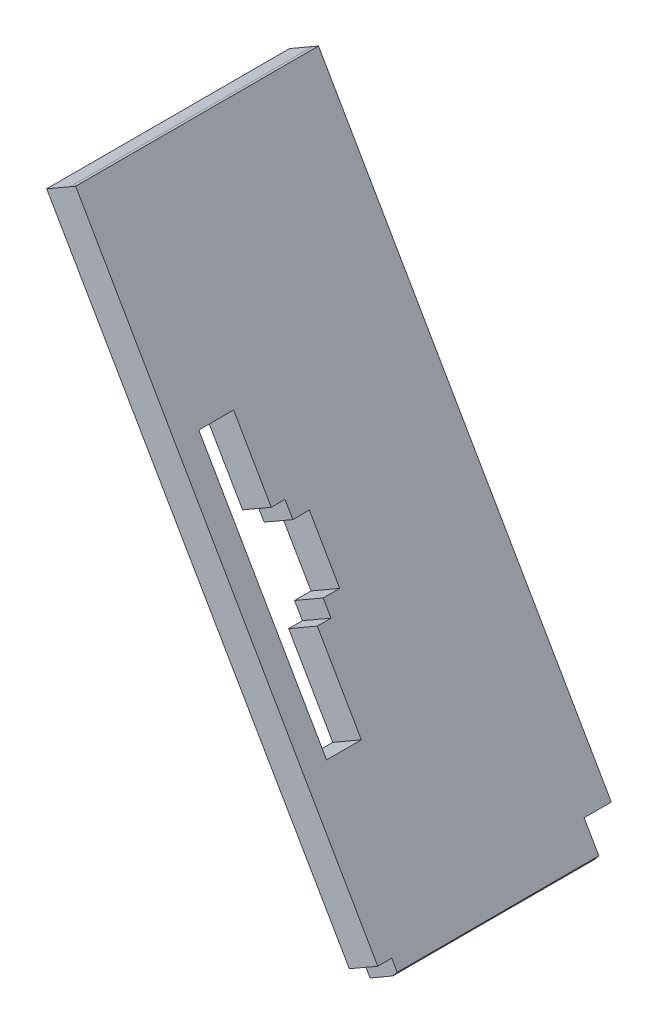
ISO-10303-21;
HEADER;
FILE_DESCRIPTION(('STEP AP214'),'2;1');
FILE_NAME('part.step','',(''),(''),'','','');
FILE_SCHEMA(('AUTOMOTIVE_DESIGN { 1 0 10303 214 1 1 1 1 }'));
ENDSEC;
DATA;
#1=APPLICATION_CONTEXT('core data for automotive mechanical design processes');
#2=APPLICATION_PROTOCOL_DEFINITION('international standard','automotive_design',2000,#1);
#3=PRODUCT_CONTEXT('',#1,'mechanical');
#4=PRODUCT('Part','Part','',(#3));
#5=PRODUCT_RELATED_PRODUCT_CATEGORY('part','',(#4));
#6=PRODUCT_DEFINITION_FORMATION('','',#4);
#7=PRODUCT_DEFINITION_CONTEXT('part definition',#1,'design');
#8=PRODUCT_DEFINITION('design','',#6,#7);
#9=PRODUCT_DEFINITION_SHAPE('','',#8);
#10=(LENGTH_UNIT() NAMED_UNIT(*) SI_UNIT(.MILLI.,.METRE.));
#11=(NAMED_UNIT(*) PLANE_ANGLE_UNIT() SI_UNIT($,.RADIAN.));
#12=(NAMED_UNIT(*) SI_UNIT($,.STERADIAN.) SOLID_ANGLE_UNIT());
#13=UNCERTAINTY_MEASURE_WITH_UNIT(LENGTH_MEASURE(1.E-05),#10,'distance_accuracy_value','');
#14=(GEOMETRIC_REPRESENTATION_CONTEXT(3) GLOBAL_UNCERTAINTY_ASSIGNED_CONTEXT((#13)) GLOBAL_UNIT_ASSIGNED_CONTEXT((#10,
#11,#12)) REPRESENTATION_CONTEXT('',''));
#15=CARTESIAN_POINT('',(0.,0.,0.));
#16=DIRECTION('',(0.,0.,1.));
#17=DIRECTION('',(1.,0.,0.));
#18=AXIS2_PLACEMENT_3D('',#15,#16,#17);
#19=CARTESIAN_POINT('',(-99.0231663196194,0.488544370295804,135.578542747507));
#20=DIRECTION('',(-0.866503571633321,-0.499170872894943,0.));
#21=DIRECTION('',(0.499170872894943,-0.866503571633321,0.));
#22=AXIS2_PLACEMENT_3D('',#19,#20,#21);
#23=PLANE('',#22);
#24=DIRECTION('',(-0.499170872894943,0.866503571633321,0.));
#25=VECTOR('',#24,1.);
#26=CARTESIAN_POINT('',(-99.0231663196194,0.488544370295804,4.14252736415929));
#27=LINE('',#26,#25);
#28=CARTESIAN_POINT('',(-52.1531074228579,-80.8725198303702,4.14252736415929));
#29=VERTEX_POINT('',#28);
#30=CARTESIAN_POINT('',(-54.4002134893503,-76.971800581344,4.14252736415929));
#31=VERTEX_POINT('',#30);
#32=EDGE_CURVE('E279',#29,#31,#27,.T.);
#33=ORIENTED_EDGE('',*,*,#32,.T.);
#34=DIRECTION('',(0.,0.,-1.));
#35=VECTOR('',#34,1.);
#36=CARTESIAN_POINT('',(-54.4002134893503,-76.971800581344,135.578542747507));
#37=LINE('',#36,#35);
#38=CARTESIAN_POINT('',(-54.4002134893503,-76.971800581344,0.));
#39=VERTEX_POINT('',#38);
#40=EDGE_CURVE('E282',#31,#39,#37,.T.);
#41=ORIENTED_EDGE('',*,*,#40,.T.);
#42=DIRECTION('',(-0.499170872894943,0.866503571633321,0.));
#43=VECTOR('',#42,1.);
#44=CARTESIAN_POINT('',(-99.0231663196194,0.488544370295804,0.));
#45=LINE('',#44,#43);
#46=CARTESIAN_POINT('',(-99.0231663196194,0.488544370295804,0.));
#47=VERTEX_POINT('',#46);
#48=EDGE_CURVE('E306',#39,#47,#45,.T.);
#49=ORIENTED_EDGE('',*,*,#48,.T.);
#50=DIRECTION('',(0.,0.,-1.));
#51=VECTOR('',#50,1.);
#52=CARTESIAN_POINT('',(-99.0231663196194,0.488544370295804,135.578542747507));
#53=LINE('',#52,#51);
#54=CARTESIAN_POINT('',(-99.0231663196194,0.488544370295804,37.));
#55=VERTEX_POINT('',#54);
#56=EDGE_CURVE('E308',#55,#47,#53,.T.);
#57=ORIENTED_EDGE('',*,*,#56,.F.);
#58=DIRECTION('',(0.499170872894943,-0.866503571633321,0.));
#59=VECTOR('',#58,1.);
#60=CARTESIAN_POINT('',(-99.0231663196194,0.488544370295804,37.));
#61=LINE('',#60,#59);
#62=CARTESIAN_POINT('',(-52.9859566816006,-79.4267887260144,37.));
#63=VERTEX_POINT('',#62);
#64=EDGE_CURVE('E291',#55,#63,#61,.T.);
#65=ORIENTED_EDGE('',*,*,#64,.T.);
#66=DIRECTION('',(0.,0.,-1.));
#67=VECTOR('',#66,1.);
#68=CARTESIAN_POINT('',(-52.9859566816006,-79.4267887260144,135.578542747507));
#69=LINE('',#68,#67);
#70=CARTESIAN_POINT('',(-52.9859566816006,-79.4267887260144,34.8637221211661));
#71=VERTEX_POINT('',#70);
#72=EDGE_CURVE('E256',#63,#71,#69,.T.);
#73=ORIENTED_EDGE('',*,*,#72,.T.);
#74=DIRECTION('',(0.499170872894943,-0.866503571633321,0.));
#75=VECTOR('',#74,1.);
#76=CARTESIAN_POINT('',(-99.0231663196194,0.488544370295804,34.8637221211661));
#77=LINE('',#76,#75);
#78=CARTESIAN_POINT('',(-52.1531074228579,-80.8725198303702,34.8637221211661));
#79=VERTEX_POINT('',#78);
#80=EDGE_CURVE('E270',#71,#79,#77,.T.);
#81=ORIENTED_EDGE('',*,*,#80,.T.);
#82=DIRECTION('',(0.,0.,-1.));
#83=VECTOR('',#82,1.);
#84=CARTESIAN_POINT('',(-52.1531074228579,-80.8725198303702,135.578542747507));
#85=LINE('',#84,#83);
#86=EDGE_CURVE('E311',#79,#29,#85,.T.);
#87=ORIENTED_EDGE('',*,*,#86,.T.);
#88=EDGE_LOOP('',(#33,#41,#49,#57,#65,#73,#81,#87));
#89=FACE_BOUND('',#88,.T.);
#90=DIRECTION('',(0.,0.,-1.));
#91=VECTOR('',#90,1.);
#92=CARTESIAN_POINT('',(-78.0849272768483,-35.8578450114659,28.2244095305818));
#93=LINE('',#92,#91);
#94=CARTESIAN_POINT('',(-78.0849272768483,-35.8578450114659,28.1244095305818));
#95=VERTEX_POINT('',#94);
#96=CARTESIAN_POINT('',(-78.0849272768483,-35.8578450114659,26.0345876074907));
#97=VERTEX_POINT('',#96);
#98=EDGE_CURVE('E186',#95,#97,#93,.T.);
#99=ORIENTED_EDGE('',*,*,#98,.T.);
#100=DIRECTION('',(0.499170872894944,-0.86650357163332,0.));
#101=VECTOR('',#100,1.);
#102=CARTESIAN_POINT('',(-78.0849272768483,-35.8578450114659,26.0345876074907));
#103=LINE('',#102,#101);
#104=CARTESIAN_POINT('',(-76.8922490162016,-37.9281981285582,26.0345876074907));
#105=VERTEX_POINT('',#104);
#106=EDGE_CURVE('E195',#97,#105,#103,.T.);
#107=ORIENTED_EDGE('',*,*,#106,.T.);
#108=DIRECTION('',(0.,0.,-1.));
#109=VECTOR('',#108,1.);
#110=CARTESIAN_POINT('',(-76.8922490162016,-37.9281981285582,26.0345876074907));
#111=LINE('',#110,#109);
#112=CARTESIAN_POINT('',(-76.8922490162016,-37.9281981285582,23.5161166286644));
#113=VERTEX_POINT('',#112);
#114=EDGE_CURVE('E201',#105,#113,#111,.T.);
#115=ORIENTED_EDGE('',*,*,#114,.T.);
#116=DIRECTION('',(0.499170872894942,-0.866503571633321,0.));
#117=VECTOR('',#116,1.);
#118=CARTESIAN_POINT('',(-76.8922490162016,-37.9281981285582,23.5161166286644));
#119=LINE('',#118,#117);
#120=CARTESIAN_POINT('',(-72.2693642825685,-45.9529975518718,23.5161166286644));
#121=VERTEX_POINT('',#120);
#122=EDGE_CURVE('E209',#113,#121,#119,.T.);
#123=ORIENTED_EDGE('',*,*,#122,.T.);
#124=DIRECTION('',(0.,0.,1.));
#125=VECTOR('',#124,1.);
#126=CARTESIAN_POINT('',(-72.2693642825685,-45.9529975518718,26.0345876074907));
#127=LINE('',#126,#125);
#128=CARTESIAN_POINT('',(-72.2693642825685,-45.9529975518718,26.0345876074907));
#129=VERTEX_POINT('',#128);
#130=EDGE_CURVE('E212',#121,#129,#127,.T.);
#131=ORIENTED_EDGE('',*,*,#130,.T.);
#132=DIRECTION('',(0.499170872894943,-0.86650357163332,0.));
#133=VECTOR('',#132,1.);
#134=CARTESIAN_POINT('',(-71.0766860219218,-48.0233506689642,26.0345876074907));
#135=LINE('',#134,#133);
#136=CARTESIAN_POINT('',(-71.0766860219218,-48.0233506689642,26.0345876074907));
#137=VERTEX_POINT('',#136);
#138=EDGE_CURVE('E215',#129,#137,#135,.T.);
#139=ORIENTED_EDGE('',*,*,#138,.T.);
#140=DIRECTION('',(0.,0.,1.));
#141=VECTOR('',#140,1.);
#142=CARTESIAN_POINT('',(-71.0766860219218,-48.0233506689642,28.7263611934285));
#143=LINE('',#142,#141);
#144=CARTESIAN_POINT('',(-71.0766860219218,-48.0233506689642,28.1244095305818));
#145=VERTEX_POINT('',#144);
#146=EDGE_CURVE('E218',#137,#145,#143,.T.);
#147=ORIENTED_EDGE('',*,*,#146,.T.);
#148=DIRECTION('',(0.499170872894943,-0.86650357163332,0.));
#149=VECTOR('',#148,1.);
#150=CARTESIAN_POINT('',(-74.1380977270059,-42.7090899203133,28.1244095305818));
#151=LINE('',#150,#149);
#152=CARTESIAN_POINT('',(-64.3623781344977,-59.6786216020566,28.1244095305818));
#153=VERTEX_POINT('',#152);
#154=EDGE_CURVE('E239',#145,#153,#151,.T.);
#155=ORIENTED_EDGE('',*,*,#154,.T.);
#156=DIRECTION('',(0.,0.,-1.));
#157=VECTOR('',#156,1.);
#158=CARTESIAN_POINT('',(-64.3623781344977,-59.6786216020566,0.));
#159=LINE('',#158,#157);
#160=CARTESIAN_POINT('',(-64.3623781344977,-59.6786216020566,33.4244095305818));
#161=VERTEX_POINT('',#160);
#162=EDGE_CURVE('E236',#161,#153,#159,.T.);
#163=ORIENTED_EDGE('',*,*,#162,.F.);
#164=DIRECTION('',(-0.499170872894943,0.86650357163332,0.));
#165=VECTOR('',#164,1.);
#166=CARTESIAN_POINT('',(-74.1380977270059,-42.7090899203133,33.4244095305818));
#167=LINE('',#166,#165);
#168=CARTESIAN_POINT('',(-83.8300421774005,-25.8849823083569,33.4244095305818));
#169=VERTEX_POINT('',#168);
#170=EDGE_CURVE('E233',#161,#169,#167,.T.);
#171=ORIENTED_EDGE('',*,*,#170,.T.);
#172=DIRECTION('',(0.,0.,-1.));
#173=VECTOR('',#172,1.);
#174=CARTESIAN_POINT('',(-83.8300421774006,-25.8849823083569,0.));
#175=LINE('',#174,#173);
#176=CARTESIAN_POINT('',(-83.8300421774006,-25.8849823083569,28.1244095305818));
#177=VERTEX_POINT('',#176);
#178=EDGE_CURVE('E56',#169,#177,#175,.T.);
#179=ORIENTED_EDGE('',*,*,#178,.T.);
#180=EDGE_CURVE('E205',#177,#95,#151,.T.);
#181=ORIENTED_EDGE('',*,*,#180,.T.);
#182=EDGE_LOOP('',(#99,#107,#115,#123,#131,#139,#147,#155,#163,#171,#179,#181));
#183=FACE_BOUND('',#182,.T.);
#184=ADVANCED_FACE('F33',(#89,#183),#23,.F.);
#185=CARTESIAN_POINT('',(-103.432664129137,-2.05617517957898,135.578542747507));
#186=DIRECTION('',(0.866025403784438,0.5,0.));
#187=DIRECTION('',(-0.5,0.866025403784438,0.));
#188=AXIS2_PLACEMENT_3D('',#185,#186,#187);
#189=PLANE('',#188);
#190=DIRECTION('',(0.5,-0.866025403784438,0.));
#191=VECTOR('',#190,1.);
#192=CARTESIAN_POINT('',(-103.432664129137,-2.05617517957898,0.));
#193=LINE('',#192,#191);
#194=CARTESIAN_POINT('',(-103.432664129137,-2.05617517957898,0.));
#195=VERTEX_POINT('',#194);
#196=CARTESIAN_POINT('',(-58.7351341000267,-79.4745681628336,0.));
#197=VERTEX_POINT('',#196);
#198=EDGE_CURVE('E303',#195,#197,#193,.T.);
#199=ORIENTED_EDGE('',*,*,#198,.T.);
#200=DIRECTION('',(0.,0.,-1.));
#201=VECTOR('',#200,1.);
#202=CARTESIAN_POINT('',(-58.7351341000267,-79.4745681628336,-0.114610865347801));
#203=LINE('',#202,#201);
#204=CARTESIAN_POINT('',(-58.7351341000267,-79.4745681628336,4.14252736415928));
#205=VERTEX_POINT('',#204);
#206=EDGE_CURVE('E251',#205,#197,#203,.T.);
#207=ORIENTED_EDGE('',*,*,#206,.F.);
#208=DIRECTION('',(0.5,-0.866025403784438,0.));
#209=VECTOR('',#208,1.);
#210=CARTESIAN_POINT('',(-103.432664129137,-2.05617517957898,4.14252736415929));
#211=LINE('',#210,#209);
#212=CARTESIAN_POINT('',(-56.2941221076292,-83.702524955551,4.14252736415929));
#213=VERTEX_POINT('',#212);
#214=EDGE_CURVE('E328',#205,#213,#211,.T.);
#215=ORIENTED_EDGE('',*,*,#214,.T.);
#216=DIRECTION('',(0.,0.,-1.));
#217=VECTOR('',#216,1.);
#218=CARTESIAN_POINT('',(-56.2941221076292,-83.702524955551,135.578542747507));
#219=LINE('',#218,#217);
#220=CARTESIAN_POINT('',(-56.2941221076292,-83.702524955551,34.8637221211661));
#221=VERTEX_POINT('',#220);
#222=EDGE_CURVE('E317',#221,#213,#219,.T.);
#223=ORIENTED_EDGE('',*,*,#222,.F.);
#224=DIRECTION('',(0.500000000000001,-0.866025403784438,0.));
#225=VECTOR('',#224,1.);
#226=CARTESIAN_POINT('',(-56.2941221076293,-83.702524955551,34.8637221211661));
#227=LINE('',#226,#225);
#228=CARTESIAN_POINT('',(-57.3185288484522,-81.9282004328296,34.8637221211661));
#229=VERTEX_POINT('',#228);
#230=EDGE_CURVE('E259',#229,#221,#227,.T.);
#231=ORIENTED_EDGE('',*,*,#230,.F.);
#232=DIRECTION('',(0.,0.,-1.));
#233=VECTOR('',#232,1.);
#234=CARTESIAN_POINT('',(-57.3185288484522,-81.9282004328296,34.8637221211661));
#235=LINE('',#234,#233);
#236=CARTESIAN_POINT('',(-57.3185288484522,-81.9282004328296,37.));
#237=VERTEX_POINT('',#236);
#238=EDGE_CURVE('E244',#237,#229,#235,.T.);
#239=ORIENTED_EDGE('',*,*,#238,.F.);
#240=DIRECTION('',(-0.5,0.866025403784438,0.));
#241=VECTOR('',#240,1.);
#242=CARTESIAN_POINT('',(-103.432664129137,-2.05617517957898,37.));
#243=LINE('',#242,#241);
#244=CARTESIAN_POINT('',(-103.432664129137,-2.05617517957898,37.));
#245=VERTEX_POINT('',#244);
#246=EDGE_CURVE('E288',#237,#245,#243,.T.);
#247=ORIENTED_EDGE('',*,*,#246,.T.);
#248=DIRECTION('',(0.,0.,-1.));
#249=VECTOR('',#248,1.);
#250=CARTESIAN_POINT('',(-103.432664129137,-2.05617517957898,135.578542747507));
#251=LINE('',#250,#249);
#252=EDGE_CURVE('E320',#245,#195,#251,.T.);
#253=ORIENTED_EDGE('',*,*,#252,.T.);
#254=EDGE_LOOP('',(#199,#207,#215,#223,#231,#239,#247,#253));
#255=FACE_BOUND('',#254,.T.);
#256=DIRECTION('',(0.,0.,-1.));
#257=VECTOR('',#256,1.);
#258=CARTESIAN_POINT('',(-82.4615947398938,-38.3791328508007,135.578542747507));
#259=LINE('',#258,#257);
#260=CARTESIAN_POINT('',(-82.4615947398938,-38.3791328508007,28.1244095305818));
#261=VERTEX_POINT('',#260);
#262=CARTESIAN_POINT('',(-82.4615947398938,-38.3791328508007,26.0345876074907));
#263=VERTEX_POINT('',#262);
#264=EDGE_CURVE('E189',#261,#263,#259,.T.);
#265=ORIENTED_EDGE('',*,*,#264,.F.);
#266=DIRECTION('',(0.5,-0.866025403784438,0.));
#267=VECTOR('',#266,1.);
#268=CARTESIAN_POINT('',(-103.432664129137,-2.05617517957898,28.1244095305818));
#269=LINE('',#268,#267);
#270=CARTESIAN_POINT('',(-88.2162549615267,-28.411768966637,28.1244095305818));
#271=VERTEX_POINT('',#270);
#272=EDGE_CURVE('E337',#271,#261,#269,.T.);
#273=ORIENTED_EDGE('',*,*,#272,.F.);
#274=DIRECTION('',(0.,0.,-1.));
#275=VECTOR('',#274,1.);
#276=CARTESIAN_POINT('',(-88.2162549615267,-28.411768966637,135.578542747507));
#277=LINE('',#276,#275);
#278=CARTESIAN_POINT('',(-88.2162549615267,-28.411768966637,33.4244095305818));
#279=VERTEX_POINT('',#278);
#280=EDGE_CURVE('E340',#279,#271,#277,.T.);
#281=ORIENTED_EDGE('',*,*,#280,.F.);
#282=DIRECTION('',(-0.5,0.866025403784438,0.));
#283=VECTOR('',#282,1.);
#284=CARTESIAN_POINT('',(-103.432664129137,-2.05617517957898,33.4244095305818));
#285=LINE('',#284,#283);
#286=CARTESIAN_POINT('',(-68.716246029584,-62.1867751848086,33.4244095305818));
#287=VERTEX_POINT('',#286);
#288=EDGE_CURVE('E331',#287,#279,#285,.T.);
#289=ORIENTED_EDGE('',*,*,#288,.F.);
#290=DIRECTION('',(0.,0.,-1.));
#291=VECTOR('',#290,1.);
#292=CARTESIAN_POINT('',(-68.716246029584,-62.1867751848086,135.578542747507));
#293=LINE('',#292,#291);
#294=CARTESIAN_POINT('',(-68.716246029584,-62.1867751848086,28.1244095305818));
#295=VERTEX_POINT('',#294);
#296=EDGE_CURVE('E333',#287,#295,#293,.T.);
#297=ORIENTED_EDGE('',*,*,#296,.T.);
#298=CARTESIAN_POINT('',(-75.4417095206347,-50.5379307138593,28.1244095305818));
#299=VERTEX_POINT('',#298);
#300=EDGE_CURVE('E336',#299,#295,#269,.T.);
#301=ORIENTED_EDGE('',*,*,#300,.F.);
#302=DIRECTION('',(0.,0.,1.));
#303=VECTOR('',#302,1.);
#304=CARTESIAN_POINT('',(-75.4417095206347,-50.5379307138593,135.578542747507));
#305=LINE('',#304,#303);
#306=CARTESIAN_POINT('',(-75.4417095206347,-50.5379307138593,26.0345876074907));
#307=VERTEX_POINT('',#306);
#308=EDGE_CURVE('E48',#307,#299,#305,.T.);
#309=ORIENTED_EDGE('',*,*,#308,.F.);
#310=DIRECTION('',(0.5,-0.866025403784438,0.));
#311=VECTOR('',#310,1.);
#312=CARTESIAN_POINT('',(-103.432664129137,-2.05617517957898,26.0345876074907));
#313=LINE('',#312,#311);
#314=CARTESIAN_POINT('',(-76.6363693773227,-48.4687191443128,26.0345876074907));
#315=VERTEX_POINT('',#314);
#316=EDGE_CURVE('E346',#315,#307,#313,.T.);
#317=ORIENTED_EDGE('',*,*,#316,.F.);
#318=DIRECTION('',(0.,0.,1.));
#319=VECTOR('',#318,1.);
#320=CARTESIAN_POINT('',(-76.6363693773227,-48.4687191443128,135.578542747507));
#321=LINE('',#320,#319);
#322=CARTESIAN_POINT('',(-76.6363693773227,-48.4687191443128,23.5161166286644));
#323=VERTEX_POINT('',#322);
#324=EDGE_CURVE('E348',#323,#315,#321,.T.);
#325=ORIENTED_EDGE('',*,*,#324,.F.);
#326=DIRECTION('',(0.5,-0.866025403784438,0.));
#327=VECTOR('',#326,1.);
#328=CARTESIAN_POINT('',(-103.432664129137,-2.05617517957898,23.5161166286644));
#329=LINE('',#328,#327);
#330=CARTESIAN_POINT('',(-81.2669348832058,-40.4483444203473,23.5161166286644));
#331=VERTEX_POINT('',#330);
#332=EDGE_CURVE('E350',#331,#323,#329,.T.);
#333=ORIENTED_EDGE('',*,*,#332,.F.);
#334=DIRECTION('',(0.,0.,-1.));
#335=VECTOR('',#334,1.);
#336=CARTESIAN_POINT('',(-81.2669348832058,-40.4483444203473,135.578542747507));
#337=LINE('',#336,#335);
#338=CARTESIAN_POINT('',(-81.2669348832058,-40.4483444203473,26.0345876074907));
#339=VERTEX_POINT('',#338);
#340=EDGE_CURVE('E41',#339,#331,#337,.T.);
#341=ORIENTED_EDGE('',*,*,#340,.F.);
#342=DIRECTION('',(0.5,-0.866025403784439,0.));
#343=VECTOR('',#342,1.);
#344=CARTESIAN_POINT('',(-103.432664129137,-2.05617517957898,26.0345876074907));
#345=LINE('',#344,#343);
#346=EDGE_CURVE('E11',#263,#339,#345,.T.);
#347=ORIENTED_EDGE('',*,*,#346,.F.);
#348=EDGE_LOOP('',(#265,#273,#281,#289,#297,#301,#309,#317,#325,#333,#341,#347));
#349=FACE_BOUND('',#348,.T.);
#350=ADVANCED_FACE('F362',(#255,#349),#189,.F.);
#351=CARTESIAN_POINT('',(-82.8031334433391,-47.7007986492627,28.1244095305818));
#352=DIRECTION('',(0.,0.,1.));
#353=DIRECTION('',(1.,0.,0.));
#354=AXIS2_PLACEMENT_3D('',#351,#352,#353);
#355=PLANE('',#354);
#356=ORIENTED_EDGE('',*,*,#272,.T.);
#357=DIRECTION('',(0.866503571633321,0.499170872894943,0.));
#358=VECTOR('',#357,1.);
#359=CARTESIAN_POINT('',(-86.7499629931815,-40.8495537404153,28.1244095305818));
#360=LINE('',#359,#358);
#361=EDGE_CURVE('E344',#261,#95,#360,.T.);
#362=ORIENTED_EDGE('',*,*,#361,.T.);
#363=ORIENTED_EDGE('',*,*,#180,.F.);
#364=DIRECTION('',(0.866503571633321,0.499170872894943,0.));
#365=VECTOR('',#364,1.);
#366=CARTESIAN_POINT('',(-92.4950778937338,-30.8766910373063,28.1244095305818));
#367=LINE('',#366,#365);
#368=EDGE_CURVE('E242',#271,#177,#367,.T.);
#369=ORIENTED_EDGE('',*,*,#368,.F.);
#370=EDGE_LOOP('',(#356,#362,#363,#369));
#371=FACE_BOUND('',#370,.T.);
#372=ADVANCED_FACE('F390',(#371),#355,.T.);
#373=ORIENTED_EDGE('',*,*,#154,.F.);
#374=DIRECTION('',(-0.866503571633321,-0.499170872894943,0.));
#375=VECTOR('',#374,1.);
#376=CARTESIAN_POINT('',(-79.741721738255,-53.0150593979136,28.1244095305818));
#377=LINE('',#376,#375);
#378=EDGE_CURVE('E342',#145,#299,#377,.T.);
#379=ORIENTED_EDGE('',*,*,#378,.T.);
#380=ORIENTED_EDGE('',*,*,#300,.T.);
#381=DIRECTION('',(0.866503571633321,0.499170872894943,0.));
#382=VECTOR('',#381,1.);
#383=CARTESIAN_POINT('',(-73.0274138508309,-64.670330331006,28.1244095305818));
#384=LINE('',#383,#382);
#385=EDGE_CURVE('E245',#295,#153,#384,.T.);
#386=ORIENTED_EDGE('',*,*,#385,.T.);
#387=EDGE_LOOP('',(#373,#379,#380,#386));
#388=FACE_BOUND('',#387,.T.);
#389=ADVANCED_FACE('F375',(#388),#355,.T.);
#390=CARTESIAN_POINT('',(0.,0.,0.));
#391=DIRECTION('',(0.,0.,-1.));
#392=DIRECTION('',(-1.,0.,0.));
#393=AXIS2_PLACEMENT_3D('',#390,#391,#392);
#394=PLANE('',#393);
#395=DIRECTION('',(0.866025403784438,0.500000000000001,0.));
#396=VECTOR('',#395,1.);
#397=CARTESIAN_POINT('',(19.7297139668993,-34.1728670094708,0.));
#398=LINE('',#397,#396);
#399=EDGE_CURVE('E285',#197,#39,#398,.T.);
#400=ORIENTED_EDGE('',*,*,#399,.F.);
#401=ORIENTED_EDGE('',*,*,#198,.F.);
#402=DIRECTION('',(-0.866025403784436,-0.500000000000005,0.));
#403=VECTOR('',#402,1.);
#404=CARTESIAN_POINT('',(-102.367816062211,-1.44138486149341,0.));
#405=LINE('',#404,#403);
#406=CARTESIAN_POINT('',(-99.8896698912527,-0.0106265025991386,0.));
#407=VERTEX_POINT('',#406);
#408=EDGE_CURVE('E300',#407,#195,#405,.T.);
#409=ORIENTED_EDGE('',*,*,#408,.F.);
#410=DIRECTION('',(-0.866503571633319,-0.499170872894945,0.));
#411=VECTOR('',#410,1.);
#412=CARTESIAN_POINT('',(-99.8896698912527,-0.0106265025991386,0.));
#413=LINE('',#412,#411);
#414=EDGE_CURVE('E287',#47,#407,#413,.T.);
#415=ORIENTED_EDGE('',*,*,#414,.F.);
#416=ORIENTED_EDGE('',*,*,#48,.F.);
#417=EDGE_LOOP('',(#400,#401,#409,#415,#416));
#418=FACE_BOUND('',#417,.T.);
#419=ADVANCED_FACE('F397',(#418),#394,.T.);
#420=CARTESIAN_POINT('',(-52.1531074228579,-80.8725198303702,135.578542747507));
#421=DIRECTION('',(-0.775135557419793,0.631794956946878,0.));
#422=DIRECTION('',(-0.631794956946878,-0.775135557419793,0.));
#423=AXIS2_PLACEMENT_3D('',#420,#421,#422);
#424=PLANE('',#423);
#425=DIRECTION('',(0.,0.,-1.));
#426=VECTOR('',#425,1.);
#427=CARTESIAN_POINT('',(-52.8292739995847,-81.7020939676703,135.578542747507));
#428=LINE('',#427,#426);
#429=CARTESIAN_POINT('',(-52.8292739995847,-81.7020939676703,34.8637221211661));
#430=VERTEX_POINT('',#429);
#431=CARTESIAN_POINT('',(-52.8292739995847,-81.7020939676703,4.14252736415929));
#432=VERTEX_POINT('',#431);
#433=EDGE_CURVE('E314',#430,#432,#428,.T.);
#434=ORIENTED_EDGE('',*,*,#433,.T.);
#435=DIRECTION('',(0.631794956946878,0.775135557419793,0.));
#436=VECTOR('',#435,1.);
#437=CARTESIAN_POINT('',(-52.1531074228579,-80.8725198303702,4.14252736415929));
#438=LINE('',#437,#436);
#439=EDGE_CURVE('E276',#432,#29,#438,.T.);
#440=ORIENTED_EDGE('',*,*,#439,.T.);
#441=ORIENTED_EDGE('',*,*,#86,.F.);
#442=DIRECTION('',(-0.631794956946878,-0.775135557419793,0.));
#443=VECTOR('',#442,1.);
#444=CARTESIAN_POINT('',(-52.1531074228579,-80.8725198303702,34.8637221211661));
#445=LINE('',#444,#443);
#446=EDGE_CURVE('E267',#79,#430,#445,.T.);
#447=ORIENTED_EDGE('',*,*,#446,.T.);
#448=EDGE_LOOP('',(#434,#440,#441,#447));
#449=FACE_BOUND('',#448,.T.);
#450=ADVANCED_FACE('F410',(#449),#424,.F.);
#451=CARTESIAN_POINT('',(-56.2941221076292,-83.702524955551,135.578542747507));
#452=DIRECTION('',(-0.500000000000001,0.866025403784438,0.));
#453=DIRECTION('',(-0.866025403784438,-0.500000000000001,0.));
#454=AXIS2_PLACEMENT_3D('',#451,#452,#453);
#455=PLANE('',#454);
#456=ORIENTED_EDGE('',*,*,#222,.T.);
#457=DIRECTION('',(0.866025403784438,0.500000000000001,0.));
#458=VECTOR('',#457,1.);
#459=CARTESIAN_POINT('',(-56.2941221076292,-83.702524955551,4.14252736415929));
#460=LINE('',#459,#458);
#461=EDGE_CURVE('E273',#213,#432,#460,.T.);
#462=ORIENTED_EDGE('',*,*,#461,.T.);
#463=ORIENTED_EDGE('',*,*,#433,.F.);
#464=DIRECTION('',(-0.866025403784438,-0.500000000000001,0.));
#465=VECTOR('',#464,1.);
#466=CARTESIAN_POINT('',(-56.2941221076292,-83.702524955551,34.8637221211661));
#467=LINE('',#466,#465);
#468=EDGE_CURVE('E264',#430,#221,#467,.T.);
#469=ORIENTED_EDGE('',*,*,#468,.T.);
#470=EDGE_LOOP('',(#456,#462,#463,#469));
#471=FACE_BOUND('',#470,.T.);
#472=ADVANCED_FACE('F413',(#471),#455,.F.);
#473=CARTESIAN_POINT('',(-102.367816062211,-1.44138486149341,135.578542747507));
#474=DIRECTION('',(0.500000000000005,-0.866025403784436,0.));
#475=DIRECTION('',(0.866025403784436,0.500000000000005,0.));
#476=AXIS2_PLACEMENT_3D('',#473,#474,#475);
#477=PLANE('',#476);
#478=ORIENTED_EDGE('',*,*,#252,.F.);
#479=DIRECTION('',(0.866025403784436,0.500000000000005,0.));
#480=VECTOR('',#479,1.);
#481=CARTESIAN_POINT('',(-102.367816062211,-1.44138486149341,37.));
#482=LINE('',#481,#480);
#483=CARTESIAN_POINT('',(-99.8896698912527,-0.0106265025991352,37.));
#484=VERTEX_POINT('',#483);
#485=EDGE_CURVE('E290',#245,#484,#482,.T.);
#486=ORIENTED_EDGE('',*,*,#485,.T.);
#487=DIRECTION('',(0.,0.,-1.));
#488=VECTOR('',#487,1.);
#489=CARTESIAN_POINT('',(-99.8896698912527,-0.0106265025991386,135.578542747507));
#490=LINE('',#489,#488);
#491=EDGE_CURVE('E322',#484,#407,#490,.T.);
#492=ORIENTED_EDGE('',*,*,#491,.T.);
#493=ORIENTED_EDGE('',*,*,#408,.T.);
#494=EDGE_LOOP('',(#478,#486,#492,#493));
#495=FACE_BOUND('',#494,.T.);
#496=ADVANCED_FACE('F416',(#495),#477,.F.);
#497=CARTESIAN_POINT('',(-99.8896698912527,-0.0106265025991386,135.578542747507));
#498=DIRECTION('',(0.499170872894945,-0.866503571633319,0.));
#499=DIRECTION('',(0.866503571633319,0.499170872894945,0.));
#500=AXIS2_PLACEMENT_3D('',#497,#498,#499);
#501=PLANE('',#500);
#502=ORIENTED_EDGE('',*,*,#491,.F.);
#503=DIRECTION('',(0.866503571633319,0.499170872894945,0.));
#504=VECTOR('',#503,1.);
#505=CARTESIAN_POINT('',(-99.8896698912527,-0.0106265025991386,37.));
#506=LINE('',#505,#504);
#507=EDGE_CURVE('E294',#484,#55,#506,.T.);
#508=ORIENTED_EDGE('',*,*,#507,.T.);
#509=ORIENTED_EDGE('',*,*,#56,.T.);
#510=ORIENTED_EDGE('',*,*,#414,.T.);
#511=EDGE_LOOP('',(#502,#508,#509,#510));
#512=FACE_BOUND('',#511,.T.);
#513=ADVANCED_FACE('F35',(#512),#501,.F.);
#514=CARTESIAN_POINT('',(-47.4999999722693,-82.2724133755319,37.));
#515=DIRECTION('',(0.,0.,-1.));
#516=DIRECTION('',(0.,1.,0.));
#517=AXIS2_PLACEMENT_3D('',#514,#515,#516);
#518=PLANE('',#517);
#519=ORIENTED_EDGE('',*,*,#246,.F.);
#520=DIRECTION('',(0.866025403784438,0.500000000000001,0.));
#521=VECTOR('',#520,1.);
#522=CARTESIAN_POINT('',(-50.1036807676609,-77.7627059512225,37.));
#523=LINE('',#522,#521);
#524=EDGE_CURVE('E297',#237,#63,#523,.T.);
#525=ORIENTED_EDGE('',*,*,#524,.T.);
#526=ORIENTED_EDGE('',*,*,#64,.F.);
#527=ORIENTED_EDGE('',*,*,#507,.F.);
#528=ORIENTED_EDGE('',*,*,#485,.F.);
#529=EDGE_LOOP('',(#519,#525,#526,#527,#528));
#530=FACE_BOUND('',#529,.T.);
#531=ADVANCED_FACE('F423',(#530),#518,.F.);
#532=CARTESIAN_POINT('',(-46.7678426660004,-78.202524955551,34.8637221211661));
#533=DIRECTION('',(0.,0.,-1.));
#534=DIRECTION('',(-1.,0.,0.));
#535=AXIS2_PLACEMENT_3D('',#532,#533,#534);
#536=PLANE('',#535);
#537=DIRECTION('',(-0.866025403784438,-0.500000000000001,0.));
#538=VECTOR('',#537,1.);
#539=CARTESIAN_POINT('',(-47.7922494068234,-76.4282004328296,34.8637221211661));
#540=LINE('',#539,#538);
#541=EDGE_CURVE('E254',#71,#229,#540,.T.);
#542=ORIENTED_EDGE('',*,*,#541,.T.);
#543=ORIENTED_EDGE('',*,*,#230,.T.);
#544=ORIENTED_EDGE('',*,*,#468,.F.);
#545=ORIENTED_EDGE('',*,*,#446,.F.);
#546=ORIENTED_EDGE('',*,*,#80,.F.);
#547=EDGE_LOOP('',(#542,#543,#544,#545,#546));
#548=FACE_BOUND('',#547,.T.);
#549=ADVANCED_FACE('F450',(#548),#536,.F.);
#550=CARTESIAN_POINT('',(-47.7922494068234,-76.4282004328296,34.8637221211661));
#551=DIRECTION('',(-0.500000000000001,0.866025403784438,0.));
#552=DIRECTION('',(-0.866025403784438,-0.500000000000001,0.));
#553=AXIS2_PLACEMENT_3D('',#550,#551,#552);
#554=PLANE('',#553);
#555=ORIENTED_EDGE('',*,*,#524,.F.);
#556=ORIENTED_EDGE('',*,*,#238,.T.);
#557=ORIENTED_EDGE('',*,*,#541,.F.);
#558=ORIENTED_EDGE('',*,*,#72,.F.);
#559=EDGE_LOOP('',(#555,#556,#557,#558));
#560=FACE_BOUND('',#559,.T.);
#561=ADVANCED_FACE('F453',(#560),#554,.F.);
#562=CARTESIAN_POINT('',(-46.7678426760288,-78.2025249381814,4.14252736415928));
#563=DIRECTION('',(0.,0.,1.));
#564=DIRECTION('',(1.,0.,0.));
#565=AXIS2_PLACEMENT_3D('',#562,#563,#564);
#566=PLANE('',#565);
#567=ORIENTED_EDGE('',*,*,#439,.F.);
#568=ORIENTED_EDGE('',*,*,#461,.F.);
#569=ORIENTED_EDGE('',*,*,#214,.F.);
#570=DIRECTION('',(-0.866025403784438,-0.500000000000001,0.));
#571=VECTOR('',#570,1.);
#572=CARTESIAN_POINT('',(-49.2088546583979,-73.9745681628336,4.14252736415928));
#573=LINE('',#572,#571);
#574=EDGE_CURVE('E253',#31,#205,#573,.T.);
#575=ORIENTED_EDGE('',*,*,#574,.F.);
#576=ORIENTED_EDGE('',*,*,#32,.F.);
#577=EDGE_LOOP('',(#567,#568,#569,#575,#576));
#578=FACE_BOUND('',#577,.T.);
#579=ADVANCED_FACE('F445',(#578),#566,.F.);
#580=CARTESIAN_POINT('',(-49.2088546583979,-73.9745681628336,-0.114610865347801));
#581=DIRECTION('',(-0.500000000000001,0.866025403784438,0.));
#582=DIRECTION('',(-0.866025403784438,-0.500000000000001,0.));
#583=AXIS2_PLACEMENT_3D('',#580,#581,#582);
#584=PLANE('',#583);
#585=ORIENTED_EDGE('',*,*,#399,.T.);
#586=ORIENTED_EDGE('',*,*,#40,.F.);
#587=ORIENTED_EDGE('',*,*,#574,.T.);
#588=ORIENTED_EDGE('',*,*,#206,.T.);
#589=EDGE_LOOP('',(#585,#586,#587,#588));
#590=FACE_BOUND('',#589,.T.);
#591=ADVANCED_FACE('F441',(#590),#584,.F.);
#592=CARTESIAN_POINT('',(-92.4950778937338,-30.8766910373063,0.));
#593=DIRECTION('',(0.499170872894943,-0.866503571633321,0.));
#594=DIRECTION('',(0.866503571633321,0.499170872894943,0.));
#595=AXIS2_PLACEMENT_3D('',#592,#593,#594);
#596=PLANE('',#595);
#597=ORIENTED_EDGE('',*,*,#280,.T.);
#598=ORIENTED_EDGE('',*,*,#368,.T.);
#599=ORIENTED_EDGE('',*,*,#178,.F.);
#600=DIRECTION('',(0.866503571633321,0.499170872894943,0.));
#601=VECTOR('',#600,1.);
#602=CARTESIAN_POINT('',(-92.4950778937338,-30.8766910373063,33.4244095305818));
#603=LINE('',#602,#601);
#604=EDGE_CURVE('E241',#279,#169,#603,.T.);
#605=ORIENTED_EDGE('',*,*,#604,.F.);
#606=EDGE_LOOP('',(#597,#598,#599,#605));
#607=FACE_BOUND('',#606,.T.);
#608=ADVANCED_FACE('F386',(#607),#596,.T.);
#609=CARTESIAN_POINT('',(-73.0274138508309,-64.670330331006,0.));
#610=DIRECTION('',(0.499170872894943,-0.866503571633321,0.));
#611=DIRECTION('',(0.866503571633321,0.499170872894943,0.));
#612=AXIS2_PLACEMENT_3D('',#609,#610,#611);
#613=PLANE('',#612);
#614=DIRECTION('',(0.866503571633321,0.499170872894943,0.));
#615=VECTOR('',#614,1.);
#616=CARTESIAN_POINT('',(-73.0274138508309,-64.670330331006,33.4244095305818));
#617=LINE('',#616,#615);
#618=EDGE_CURVE('E248',#287,#161,#617,.T.);
#619=ORIENTED_EDGE('',*,*,#618,.T.);
#620=ORIENTED_EDGE('',*,*,#162,.T.);
#621=ORIENTED_EDGE('',*,*,#385,.F.);
#622=ORIENTED_EDGE('',*,*,#296,.F.);
#623=EDGE_LOOP('',(#619,#620,#621,#622));
#624=FACE_BOUND('',#623,.T.);
#625=ADVANCED_FACE('F380',(#624),#613,.F.);
#626=CARTESIAN_POINT('',(-82.8031334433391,-47.7007986492627,33.4244095305818));
#627=DIRECTION('',(0.,0.,-1.));
#628=DIRECTION('',(-1.,0.,0.));
#629=AXIS2_PLACEMENT_3D('',#626,#627,#628);
#630=PLANE('',#629);
#631=ORIENTED_EDGE('',*,*,#288,.T.);
#632=ORIENTED_EDGE('',*,*,#604,.T.);
#633=ORIENTED_EDGE('',*,*,#170,.F.);
#634=ORIENTED_EDGE('',*,*,#618,.F.);
#635=EDGE_LOOP('',(#631,#632,#633,#634));
#636=FACE_BOUND('',#635,.T.);
#637=ADVANCED_FACE('F383',(#636),#630,.T.);
#638=CARTESIAN_POINT('',(-84.1504522782815,-39.3520411217305,26.0345876074907));
#639=DIRECTION('',(0.,0.,1.));
#640=DIRECTION('',(1.,0.,0.));
#641=AXIS2_PLACEMENT_3D('',#638,#639,#640);
#642=PLANE('',#641);
#643=ORIENTED_EDGE('',*,*,#346,.T.);
#644=DIRECTION('',(0.86650357163332,0.499170872894943,0.));
#645=VECTOR('',#644,1.);
#646=CARTESIAN_POINT('',(-82.9577740176349,-41.4223942388228,26.0345876074907));
#647=LINE('',#646,#645);
#648=EDGE_CURVE('E192',#339,#105,#647,.T.);
#649=ORIENTED_EDGE('',*,*,#648,.T.);
#650=ORIENTED_EDGE('',*,*,#106,.F.);
#651=DIRECTION('',(0.86650357163332,0.499170872894943,0.));
#652=VECTOR('',#651,1.);
#653=CARTESIAN_POINT('',(-84.1504522782815,-39.3520411217305,26.0345876074907));
#654=LINE('',#653,#652);
#655=EDGE_CURVE('E182',#263,#97,#654,.T.);
#656=ORIENTED_EDGE('',*,*,#655,.F.);
#657=EDGE_LOOP('',(#643,#649,#650,#656));
#658=FACE_BOUND('',#657,.T.);
#659=ADVANCED_FACE('F196',(#658),#642,.T.);
#660=CARTESIAN_POINT('',(-82.9577740176349,-41.4223942388228,26.0345876074907));
#661=DIRECTION('',(0.499170872894943,-0.86650357163332,0.));
#662=DIRECTION('',(0.866503571633321,0.499170872894943,0.));
#663=AXIS2_PLACEMENT_3D('',#660,#661,#662);
#664=PLANE('',#663);
#665=ORIENTED_EDGE('',*,*,#340,.T.);
#666=DIRECTION('',(0.86650357163332,0.499170872894943,0.));
#667=VECTOR('',#666,1.);
#668=CARTESIAN_POINT('',(-82.9577740176349,-41.4223942388228,23.5161166286644));
#669=LINE('',#668,#667);
#670=EDGE_CURVE('E227',#331,#113,#669,.T.);
#671=ORIENTED_EDGE('',*,*,#670,.T.);
#672=ORIENTED_EDGE('',*,*,#114,.F.);
#673=ORIENTED_EDGE('',*,*,#648,.F.);
#674=EDGE_LOOP('',(#665,#671,#672,#673));
#675=FACE_BOUND('',#674,.T.);
#676=ADVANCED_FACE('F354',(#675),#664,.T.);
#677=CARTESIAN_POINT('',(-82.9577740176349,-41.4223942388228,23.5161166286644));
#678=DIRECTION('',(0.,0.,1.));
#679=DIRECTION('',(1.,0.,0.));
#680=AXIS2_PLACEMENT_3D('',#677,#678,#679);
#681=PLANE('',#680);
#682=ORIENTED_EDGE('',*,*,#332,.T.);
#683=DIRECTION('',(0.86650357163332,0.499170872894943,0.));
#684=VECTOR('',#683,1.);
#685=CARTESIAN_POINT('',(-78.3348892840017,-49.4471936621364,23.5161166286644));
#686=LINE('',#685,#684);
#687=EDGE_CURVE('E225',#323,#121,#686,.T.);
#688=ORIENTED_EDGE('',*,*,#687,.T.);
#689=ORIENTED_EDGE('',*,*,#122,.F.);
#690=ORIENTED_EDGE('',*,*,#670,.F.);
#691=EDGE_LOOP('',(#682,#688,#689,#690));
#692=FACE_BOUND('',#691,.T.);
#693=ADVANCED_FACE('F359',(#692),#681,.T.);
#694=CARTESIAN_POINT('',(-78.3348892840017,-49.4471936621364,26.0345876074907));
#695=DIRECTION('',(-0.499170872894943,0.86650357163332,0.));
#696=DIRECTION('',(-0.866503571633321,-0.499170872894943,0.));
#697=AXIS2_PLACEMENT_3D('',#694,#695,#696);
#698=PLANE('',#697);
#699=ORIENTED_EDGE('',*,*,#324,.T.);
#700=DIRECTION('',(0.86650357163332,0.499170872894943,0.));
#701=VECTOR('',#700,1.);
#702=CARTESIAN_POINT('',(-78.3348892840017,-49.4471936621364,26.0345876074907));
#703=LINE('',#702,#701);
#704=EDGE_CURVE('E223',#315,#129,#703,.T.);
#705=ORIENTED_EDGE('',*,*,#704,.T.);
#706=ORIENTED_EDGE('',*,*,#130,.F.);
#707=ORIENTED_EDGE('',*,*,#687,.F.);
#708=EDGE_LOOP('',(#699,#705,#706,#707));
#709=FACE_BOUND('',#708,.T.);
#710=ADVANCED_FACE('F366',(#709),#698,.T.);
#711=CARTESIAN_POINT('',(-77.142211023355,-51.5175467792288,26.0345876074907));
#712=DIRECTION('',(0.,0.,1.));
#713=DIRECTION('',(1.,0.,0.));
#714=AXIS2_PLACEMENT_3D('',#711,#712,#713);
#715=PLANE('',#714);
#716=ORIENTED_EDGE('',*,*,#316,.T.);
#717=DIRECTION('',(0.86650357163332,0.499170872894943,0.));
#718=VECTOR('',#717,1.);
#719=CARTESIAN_POINT('',(-77.142211023355,-51.5175467792288,26.0345876074907));
#720=LINE('',#719,#718);
#721=EDGE_CURVE('E221',#307,#137,#720,.T.);
#722=ORIENTED_EDGE('',*,*,#721,.T.);
#723=ORIENTED_EDGE('',*,*,#138,.F.);
#724=ORIENTED_EDGE('',*,*,#704,.F.);
#725=EDGE_LOOP('',(#716,#722,#723,#724));
#726=FACE_BOUND('',#725,.T.);
#727=ADVANCED_FACE('F370',(#726),#715,.T.);
#728=CARTESIAN_POINT('',(-84.1504522782815,-39.3520411217305,28.2244095305818));
#729=DIRECTION('',(0.499170872894943,-0.86650357163332,0.));
#730=DIRECTION('',(0.866503571633321,0.499170872894943,0.));
#731=AXIS2_PLACEMENT_3D('',#728,#729,#730);
#732=PLANE('',#731);
#733=ORIENTED_EDGE('',*,*,#264,.T.);
#734=ORIENTED_EDGE('',*,*,#655,.T.);
#735=ORIENTED_EDGE('',*,*,#98,.F.);
#736=ORIENTED_EDGE('',*,*,#361,.F.);
#737=EDGE_LOOP('',(#733,#734,#735,#736));
#738=FACE_BOUND('',#737,.T.);
#739=ADVANCED_FACE('F184',(#738),#732,.T.);
#740=CARTESIAN_POINT('',(-77.142211023355,-51.5175467792288,28.7263611934285));
#741=DIRECTION('',(-0.499170872894943,0.86650357163332,0.));
#742=DIRECTION('',(-0.866503571633321,-0.499170872894943,0.));
#743=AXIS2_PLACEMENT_3D('',#740,#741,#742);
#744=PLANE('',#743);
#745=ORIENTED_EDGE('',*,*,#308,.T.);
#746=ORIENTED_EDGE('',*,*,#378,.F.);
#747=ORIENTED_EDGE('',*,*,#146,.F.);
#748=ORIENTED_EDGE('',*,*,#721,.F.);
#749=EDGE_LOOP('',(#745,#746,#747,#748));
#750=FACE_BOUND('',#749,.T.);
#751=ADVANCED_FACE('F588',(#750),#744,.T.);
#752=CLOSED_SHELL('',(#184,#350,#372,#389,#419,#450,#472,#496,#513,#531,#549,#561,#579,#591,
#608,#625,#637,#659,#676,#693,#710,#727,#739,#751));
#753=MANIFOLD_SOLID_BREP('B2',#752);
#754=ADVANCED_BREP_SHAPE_REPRESENTATION('',(#18,#753),#14);
#755=SHAPE_DEFINITION_REPRESENTATION(#9,#754);
ENDSEC;
END-ISO-10303-21;
